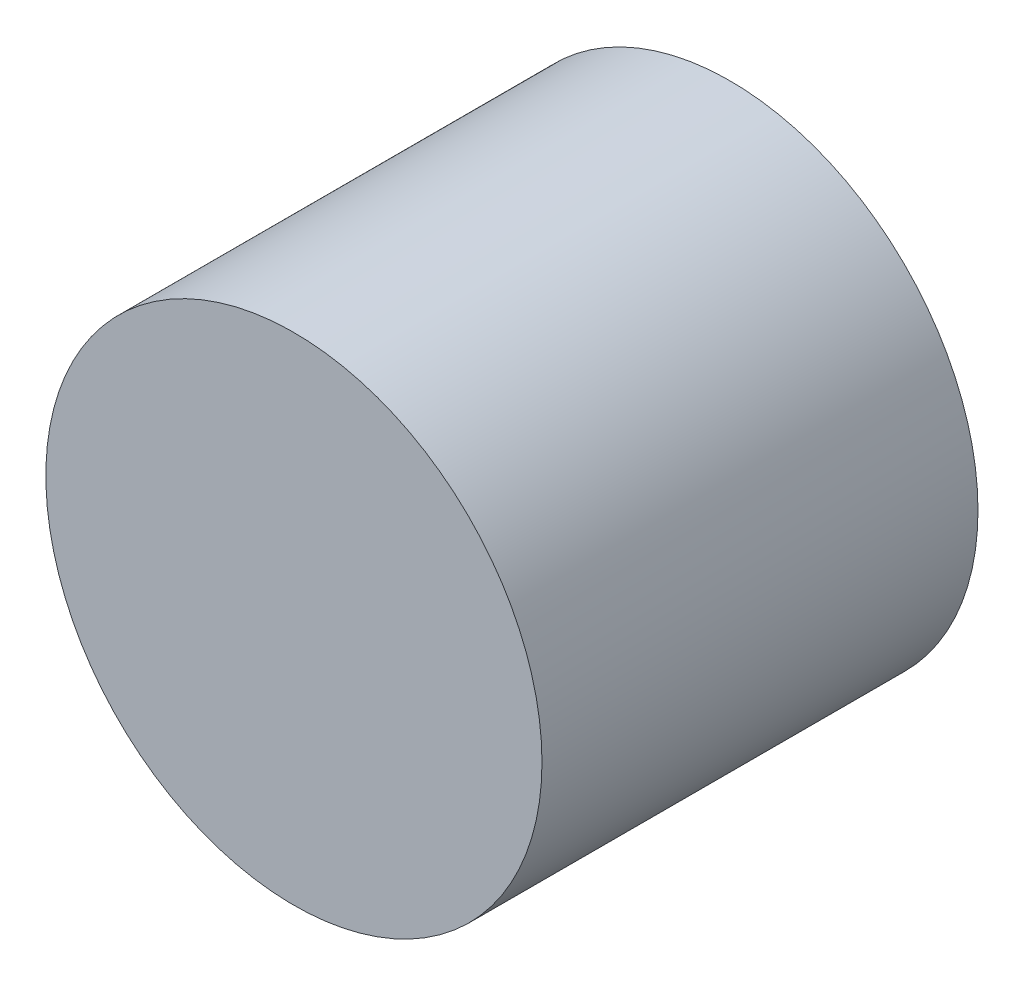
ISO-10303-21;
HEADER;
FILE_DESCRIPTION(('STEP AP214'),'2;1');
FILE_NAME('part.step','',(''),(''),'','','');
FILE_SCHEMA(('AUTOMOTIVE_DESIGN { 1 0 10303 214 1 1 1 1 }'));
ENDSEC;
DATA;
#1=APPLICATION_CONTEXT('core data for automotive mechanical design processes');
#2=APPLICATION_PROTOCOL_DEFINITION('international standard','automotive_design',2000,#1);
#3=PRODUCT_CONTEXT('',#1,'mechanical');
#4=PRODUCT('Part','Part','',(#3));
#5=PRODUCT_RELATED_PRODUCT_CATEGORY('part','',(#4));
#6=PRODUCT_DEFINITION_FORMATION('','',#4);
#7=PRODUCT_DEFINITION_CONTEXT('part definition',#1,'design');
#8=PRODUCT_DEFINITION('design','',#6,#7);
#9=PRODUCT_DEFINITION_SHAPE('','',#8);
#10=(LENGTH_UNIT() NAMED_UNIT(*) SI_UNIT(.MILLI.,.METRE.));
#11=(NAMED_UNIT(*) PLANE_ANGLE_UNIT() SI_UNIT($,.RADIAN.));
#12=(NAMED_UNIT(*) SI_UNIT($,.STERADIAN.) SOLID_ANGLE_UNIT());
#13=UNCERTAINTY_MEASURE_WITH_UNIT(LENGTH_MEASURE(1.E-05),#10,'distance_accuracy_value','');
#14=(GEOMETRIC_REPRESENTATION_CONTEXT(3) GLOBAL_UNCERTAINTY_ASSIGNED_CONTEXT((#13)) GLOBAL_UNIT_ASSIGNED_CONTEXT((#10,
#11,#12)) REPRESENTATION_CONTEXT('',''));
#15=CARTESIAN_POINT('',(0.,0.,0.));
#16=DIRECTION('',(0.,0.,1.));
#17=DIRECTION('',(1.,0.,0.));
#18=AXIS2_PLACEMENT_3D('',#15,#16,#17);
#19=CARTESIAN_POINT('',(0.,0.,14.5));
#20=DIRECTION('',(0.,0.,-1.));
#21=DIRECTION('',(-1.,0.,0.));
#22=AXIS2_PLACEMENT_3D('',#19,#20,#21);
#23=CYLINDRICAL_SURFACE('',#22,16.5);
#24=CARTESIAN_POINT('',(0.,0.,14.5));
#25=DIRECTION('',(0.,0.,1.));
#26=DIRECTION('',(1.,0.,0.));
#27=AXIS2_PLACEMENT_3D('',#24,#25,#26);
#28=CIRCLE('',#27,16.5);
#29=CARTESIAN_POINT('',(16.5,0.,14.5));
#30=VERTEX_POINT('',#29);
#31=EDGE_CURVE('E10',#30,#30,#28,.T.);
#32=ORIENTED_EDGE('',*,*,#31,.F.);
#33=EDGE_LOOP('',(#32));
#34=FACE_BOUND('',#33,.T.);
#35=CARTESIAN_POINT('',(0.,0.,-14.5));
#36=DIRECTION('',(0.,0.,1.));
#37=DIRECTION('',(1.,0.,0.));
#38=AXIS2_PLACEMENT_3D('',#35,#36,#37);
#39=CIRCLE('',#38,16.5);
#40=CARTESIAN_POINT('',(16.5,0.,-14.5));
#41=VERTEX_POINT('',#40);
#42=EDGE_CURVE('E33',#41,#41,#39,.T.);
#43=ORIENTED_EDGE('',*,*,#42,.T.);
#44=EDGE_LOOP('',(#43));
#45=FACE_BOUND('',#44,.T.);
#46=ADVANCED_FACE('F30',(#34,#45),#23,.T.);
#47=CARTESIAN_POINT('',(0.,0.,14.5));
#48=DIRECTION('',(0.,0.,1.));
#49=DIRECTION('',(1.,0.,0.));
#50=AXIS2_PLACEMENT_3D('',#47,#48,#49);
#51=PLANE('',#50);
#52=ORIENTED_EDGE('',*,*,#31,.T.);
#53=EDGE_LOOP('',(#52));
#54=FACE_BOUND('',#53,.T.);
#55=ADVANCED_FACE('F45',(#54),#51,.T.);
#56=CARTESIAN_POINT('',(0.,0.,-14.5));
#57=DIRECTION('',(0.,0.,1.));
#58=DIRECTION('',(1.,0.,0.));
#59=AXIS2_PLACEMENT_3D('',#56,#57,#58);
#60=PLANE('',#59);
#61=ORIENTED_EDGE('',*,*,#42,.F.);
#62=EDGE_LOOP('',(#61));
#63=FACE_BOUND('',#62,.T.);
#64=ADVANCED_FACE('F43',(#63),#60,.F.);
#65=CLOSED_SHELL('',(#46,#55,#64));
#66=MANIFOLD_SOLID_BREP('B2',#65);
#67=ADVANCED_BREP_SHAPE_REPRESENTATION('',(#18,#66),#14);
#68=SHAPE_DEFINITION_REPRESENTATION(#9,#67);
ENDSEC;
END-ISO-10303-21;
